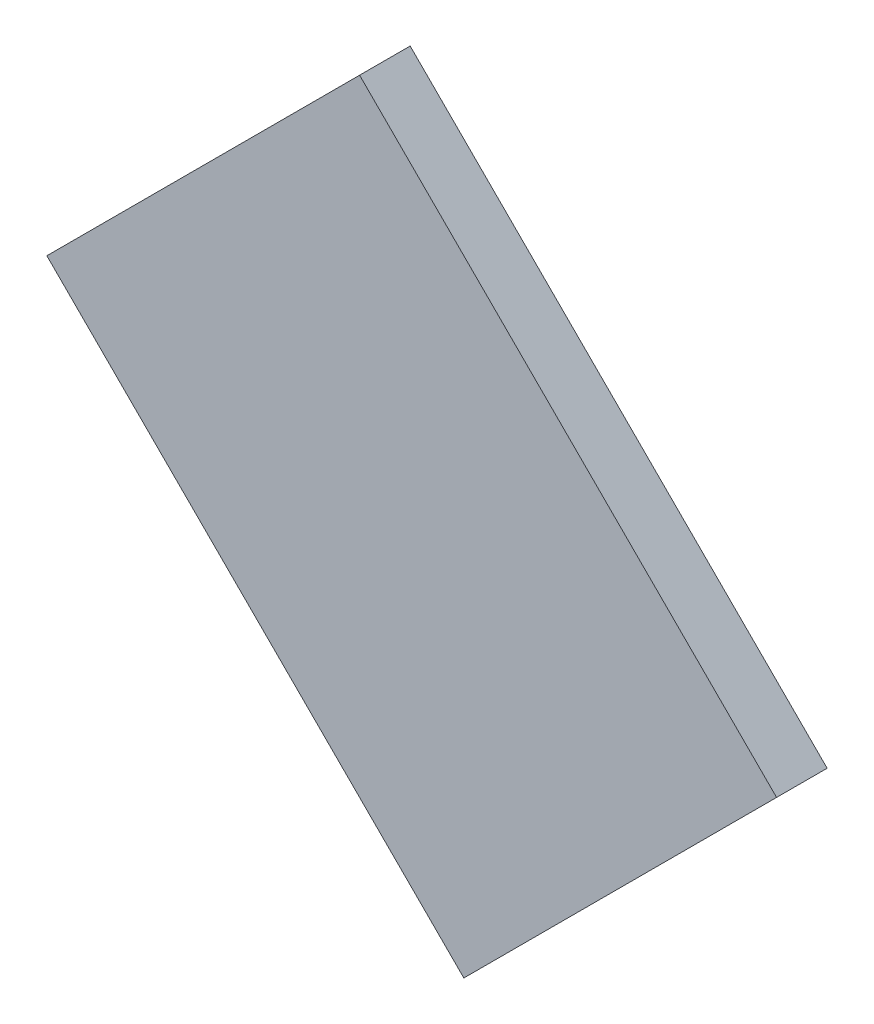
ISO-10303-21;
HEADER;
FILE_DESCRIPTION(('STEP AP214'),'2;1');
FILE_NAME('part.step','',(''),(''),'','','');
FILE_SCHEMA(('AUTOMOTIVE_DESIGN { 1 0 10303 214 1 1 1 1 }'));
ENDSEC;
DATA;
#1=APPLICATION_CONTEXT('core data for automotive mechanical design processes');
#2=APPLICATION_PROTOCOL_DEFINITION('international standard','automotive_design',2000,#1);
#3=PRODUCT_CONTEXT('',#1,'mechanical');
#4=PRODUCT('Part','Part','',(#3));
#5=PRODUCT_RELATED_PRODUCT_CATEGORY('part','',(#4));
#6=PRODUCT_DEFINITION_FORMATION('','',#4);
#7=PRODUCT_DEFINITION_CONTEXT('part definition',#1,'design');
#8=PRODUCT_DEFINITION('design','',#6,#7);
#9=PRODUCT_DEFINITION_SHAPE('','',#8);
#10=(LENGTH_UNIT() NAMED_UNIT(*) SI_UNIT(.MILLI.,.METRE.));
#11=(NAMED_UNIT(*) PLANE_ANGLE_UNIT() SI_UNIT($,.RADIAN.));
#12=(NAMED_UNIT(*) SI_UNIT($,.STERADIAN.) SOLID_ANGLE_UNIT());
#13=UNCERTAINTY_MEASURE_WITH_UNIT(LENGTH_MEASURE(1.E-05),#10,'distance_accuracy_value','');
#14=(GEOMETRIC_REPRESENTATION_CONTEXT(3) GLOBAL_UNCERTAINTY_ASSIGNED_CONTEXT((#13)) GLOBAL_UNIT_ASSIGNED_CONTEXT((#10,
#11,#12)) REPRESENTATION_CONTEXT('',''));
#15=CARTESIAN_POINT('',(0.,0.,0.));
#16=DIRECTION('',(0.,0.,1.));
#17=DIRECTION('',(1.,0.,0.));
#18=AXIS2_PLACEMENT_3D('',#15,#16,#17);
#19=CARTESIAN_POINT('',(7.9014546665,8.8384546665,0.79916));
#20=DIRECTION('',(0.,0.,1.));
#21=DIRECTION('',(0.,-1.,0.));
#22=AXIS2_PLACEMENT_3D('',#19,#20,#21);
#23=PLANE('',#22);
#24=DIRECTION('',(0.707106781186548,0.707106781186548,0.));
#25=VECTOR('',#24,1.);
#26=CARTESIAN_POINT('',(7.653967333,8.87381,0.79916));
#27=LINE('',#26,#25);
#28=CARTESIAN_POINT('',(7.866099333,9.085942,0.79916));
#29=VERTEX_POINT('',#28);
#30=CARTESIAN_POINT('',(7.653967333,8.87381,0.79916));
#31=VERTEX_POINT('',#30);
#32=EDGE_CURVE('E68',#29,#31,#27,.F.);
#33=ORIENTED_EDGE('',*,*,#32,.T.);
#34=DIRECTION('',(-0.707106781186548,0.707106781186548,0.));
#35=VECTOR('',#34,1.);
#36=CARTESIAN_POINT('',(7.93681,8.590967333,0.79916));
#37=LINE('',#36,#35);
#38=CARTESIAN_POINT('',(7.93681,8.590967333,0.79916));
#39=VERTEX_POINT('',#38);
#40=EDGE_CURVE('E55',#31,#39,#37,.F.);
#41=ORIENTED_EDGE('',*,*,#40,.T.);
#42=DIRECTION('',(-0.707106781186548,-0.707106781186548,0.));
#43=VECTOR('',#42,1.);
#44=CARTESIAN_POINT('',(8.148942,8.803099333,0.79916));
#45=LINE('',#44,#43);
#46=CARTESIAN_POINT('',(8.148942,8.803099333,0.79916));
#47=VERTEX_POINT('',#46);
#48=EDGE_CURVE('E20',#39,#47,#45,.F.);
#49=ORIENTED_EDGE('',*,*,#48,.T.);
#50=DIRECTION('',(0.707106781186548,-0.707106781186548,0.));
#51=VECTOR('',#50,1.);
#52=CARTESIAN_POINT('',(7.866099333,9.085942,0.79916));
#53=LINE('',#52,#51);
#54=EDGE_CURVE('E81',#47,#29,#53,.F.);
#55=ORIENTED_EDGE('',*,*,#54,.T.);
#56=EDGE_LOOP('',(#33,#41,#49,#55));
#57=FACE_BOUND('',#56,.T.);
#58=ADVANCED_FACE('F17',(#57),#23,.T.);
#59=CARTESIAN_POINT('',(8.148942,8.803099333,0.76487));
#60=DIRECTION('',(-0.707106781186548,0.707106781186548,0.));
#61=DIRECTION('',(-0.707106781186548,-0.707106781186548,0.));
#62=AXIS2_PLACEMENT_3D('',#59,#60,#61);
#63=PLANE('',#62);
#64=DIRECTION('',(0.,0.,1.));
#65=VECTOR('',#64,1.);
#66=CARTESIAN_POINT('',(7.93681,8.590967333,0.76487));
#67=LINE('',#66,#65);
#68=CARTESIAN_POINT('',(7.93681,8.590967333,0.76487));
#69=VERTEX_POINT('',#68);
#70=EDGE_CURVE('E61',#39,#69,#67,.F.);
#71=ORIENTED_EDGE('',*,*,#70,.T.);
#72=DIRECTION('',(-0.707106781186545,-0.70710678118655,0.));
#73=VECTOR('',#72,1.);
#74=CARTESIAN_POINT('',(8.148942,8.803099333,0.76487));
#75=LINE('',#74,#73);
#76=CARTESIAN_POINT('',(8.148942,8.803099333,0.76487));
#77=VERTEX_POINT('',#76);
#78=EDGE_CURVE('E83',#77,#69,#75,.T.);
#79=ORIENTED_EDGE('',*,*,#78,.F.);
#80=DIRECTION('',(0.,0.,1.));
#81=VECTOR('',#80,1.);
#82=CARTESIAN_POINT('',(8.148942,8.803099333,0.76487));
#83=LINE('',#82,#81);
#84=EDGE_CURVE('E64',#77,#47,#83,.T.);
#85=ORIENTED_EDGE('',*,*,#84,.T.);
#86=ORIENTED_EDGE('',*,*,#48,.F.);
#87=EDGE_LOOP('',(#71,#79,#85,#86));
#88=FACE_BOUND('',#87,.T.);
#89=ADVANCED_FACE('F60',(#88),#63,.F.);
#90=CARTESIAN_POINT('',(7.93681,8.590967333,0.76487));
#91=DIRECTION('',(0.707106781186548,0.707106781186548,0.));
#92=DIRECTION('',(-0.707106781186548,0.707106781186548,0.));
#93=AXIS2_PLACEMENT_3D('',#90,#91,#92);
#94=PLANE('',#93);
#95=DIRECTION('',(0.,0.,1.));
#96=VECTOR('',#95,1.);
#97=CARTESIAN_POINT('',(7.653967333,8.87381,0.76487));
#98=LINE('',#97,#96);
#99=CARTESIAN_POINT('',(7.653967333,8.87381,0.76487));
#100=VERTEX_POINT('',#99);
#101=EDGE_CURVE('E70',#31,#100,#98,.F.);
#102=ORIENTED_EDGE('',*,*,#101,.T.);
#103=DIRECTION('',(-0.707106781186548,0.707106781186548,0.));
#104=VECTOR('',#103,1.);
#105=CARTESIAN_POINT('',(7.93681,8.590967333,0.76487));
#106=LINE('',#105,#104);
#107=EDGE_CURVE('E74',#69,#100,#106,.T.);
#108=ORIENTED_EDGE('',*,*,#107,.F.);
#109=ORIENTED_EDGE('',*,*,#70,.F.);
#110=ORIENTED_EDGE('',*,*,#40,.F.);
#111=EDGE_LOOP('',(#102,#108,#109,#110));
#112=FACE_BOUND('',#111,.T.);
#113=ADVANCED_FACE('F72',(#112),#94,.F.);
#114=CARTESIAN_POINT('',(7.653967333,8.87381,0.76487));
#115=DIRECTION('',(0.707106781186548,-0.707106781186548,0.));
#116=DIRECTION('',(0.707106781186548,0.707106781186548,0.));
#117=AXIS2_PLACEMENT_3D('',#114,#115,#116);
#118=PLANE('',#117);
#119=DIRECTION('',(0.,0.,1.));
#120=VECTOR('',#119,1.);
#121=CARTESIAN_POINT('',(7.866099333,9.085942,0.76487));
#122=LINE('',#121,#120);
#123=CARTESIAN_POINT('',(7.866099333,9.085942,0.76487));
#124=VERTEX_POINT('',#123);
#125=EDGE_CURVE('E35',#29,#124,#122,.F.);
#126=ORIENTED_EDGE('',*,*,#125,.T.);
#127=DIRECTION('',(0.70710678118655,0.707106781186545,0.));
#128=VECTOR('',#127,1.);
#129=CARTESIAN_POINT('',(7.653967333,8.87381,0.76487));
#130=LINE('',#129,#128);
#131=EDGE_CURVE('E26',#100,#124,#130,.T.);
#132=ORIENTED_EDGE('',*,*,#131,.F.);
#133=ORIENTED_EDGE('',*,*,#101,.F.);
#134=ORIENTED_EDGE('',*,*,#32,.F.);
#135=EDGE_LOOP('',(#126,#132,#133,#134));
#136=FACE_BOUND('',#135,.T.);
#137=ADVANCED_FACE('F89',(#136),#118,.F.);
#138=CARTESIAN_POINT('',(7.866099333,9.085942,0.76487));
#139=DIRECTION('',(-0.707106781186548,-0.707106781186548,0.));
#140=DIRECTION('',(0.707106781186548,-0.707106781186548,0.));
#141=AXIS2_PLACEMENT_3D('',#138,#139,#140);
#142=PLANE('',#141);
#143=ORIENTED_EDGE('',*,*,#84,.F.);
#144=DIRECTION('',(0.707106781186548,-0.707106781186548,0.));
#145=VECTOR('',#144,1.);
#146=CARTESIAN_POINT('',(7.866099333,9.085942,0.76487));
#147=LINE('',#146,#145);
#148=EDGE_CURVE('E11',#124,#77,#147,.T.);
#149=ORIENTED_EDGE('',*,*,#148,.F.);
#150=ORIENTED_EDGE('',*,*,#125,.F.);
#151=ORIENTED_EDGE('',*,*,#54,.F.);
#152=EDGE_LOOP('',(#143,#149,#150,#151));
#153=FACE_BOUND('',#152,.T.);
#154=ADVANCED_FACE('F91',(#153),#142,.F.);
#155=CARTESIAN_POINT('',(7.9014546665,8.8384546665,0.76487));
#156=DIRECTION('',(0.,0.,-1.));
#157=DIRECTION('',(0.,1.,0.));
#158=AXIS2_PLACEMENT_3D('',#155,#156,#157);
#159=PLANE('',#158);
#160=ORIENTED_EDGE('',*,*,#131,.T.);
#161=ORIENTED_EDGE('',*,*,#148,.T.);
#162=ORIENTED_EDGE('',*,*,#78,.T.);
#163=ORIENTED_EDGE('',*,*,#107,.T.);
#164=EDGE_LOOP('',(#160,#161,#162,#163));
#165=FACE_BOUND('',#164,.T.);
#166=ADVANCED_FACE('F88',(#165),#159,.T.);
#167=CLOSED_SHELL('',(#58,#89,#113,#137,#154,#166));
#168=MANIFOLD_SOLID_BREP('B1',#167);
#169=ADVANCED_BREP_SHAPE_REPRESENTATION('',(#18,#168),#14);
#170=SHAPE_DEFINITION_REPRESENTATION(#9,#169);
ENDSEC;
END-ISO-10303-21;
